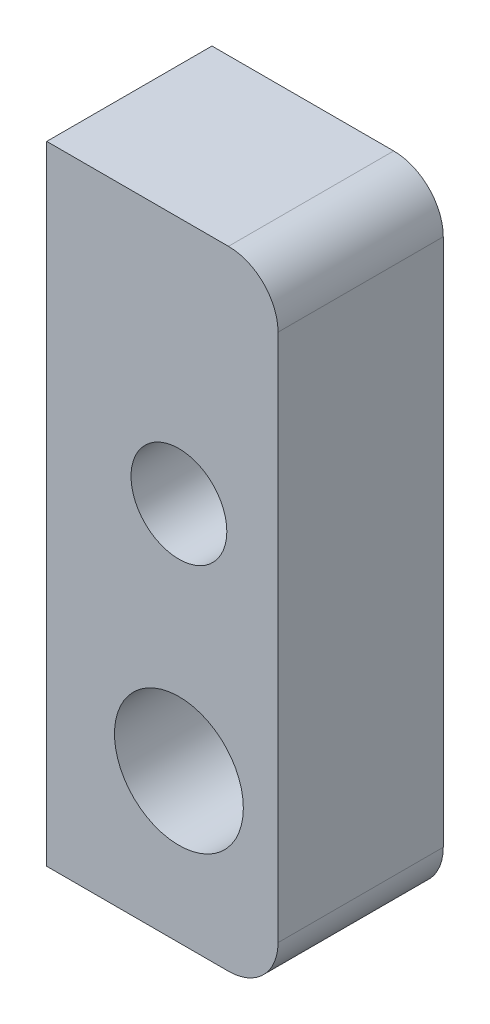
ISO-10303-21;
HEADER;
FILE_DESCRIPTION(('STEP AP214'),'2;1');
FILE_NAME('part.step','',(''),(''),'','','');
FILE_SCHEMA(('AUTOMOTIVE_DESIGN { 1 0 10303 214 1 1 1 1 }'));
ENDSEC;
DATA;
#1=APPLICATION_CONTEXT('core data for automotive mechanical design processes');
#2=APPLICATION_PROTOCOL_DEFINITION('international standard','automotive_design',2000,#1);
#3=PRODUCT_CONTEXT('',#1,'mechanical');
#4=PRODUCT('Part','Part','',(#3));
#5=PRODUCT_RELATED_PRODUCT_CATEGORY('part','',(#4));
#6=PRODUCT_DEFINITION_FORMATION('','',#4);
#7=PRODUCT_DEFINITION_CONTEXT('part definition',#1,'design');
#8=PRODUCT_DEFINITION('design','',#6,#7);
#9=PRODUCT_DEFINITION_SHAPE('','',#8);
#10=(LENGTH_UNIT() NAMED_UNIT(*) SI_UNIT(.MILLI.,.METRE.));
#11=(NAMED_UNIT(*) PLANE_ANGLE_UNIT() SI_UNIT($,.RADIAN.));
#12=(NAMED_UNIT(*) SI_UNIT($,.STERADIAN.) SOLID_ANGLE_UNIT());
#13=UNCERTAINTY_MEASURE_WITH_UNIT(LENGTH_MEASURE(1.E-05),#10,'distance_accuracy_value','');
#14=(GEOMETRIC_REPRESENTATION_CONTEXT(3) GLOBAL_UNCERTAINTY_ASSIGNED_CONTEXT((#13)) GLOBAL_UNIT_ASSIGNED_CONTEXT((#10,
#11,#12)) REPRESENTATION_CONTEXT('',''));
#15=CARTESIAN_POINT('',(0.,0.,0.));
#16=DIRECTION('',(0.,0.,1.));
#17=DIRECTION('',(1.,0.,0.));
#18=AXIS2_PLACEMENT_3D('',#15,#16,#17);
#19=CARTESIAN_POINT('',(20.,-9.49999999999999,-5.));
#20=DIRECTION('',(0.,-1.,0.));
#21=DIRECTION('',(0.,0.,-1.));
#22=AXIS2_PLACEMENT_3D('',#19,#20,#21);
#23=PLANE('',#22);
#24=DIRECTION('',(1.,0.,0.));
#25=VECTOR('',#24,1.);
#26=CARTESIAN_POINT('',(20.,-9.49999999999999,0.));
#27=LINE('',#26,#25);
#28=CARTESIAN_POINT('',(20.,-9.49999999999999,0.));
#29=VERTEX_POINT('',#28);
#30=CARTESIAN_POINT('',(25.5,-9.49999999999999,0.));
#31=VERTEX_POINT('',#30);
#32=EDGE_CURVE('E118',#29,#31,#27,.T.);
#33=ORIENTED_EDGE('',*,*,#32,.F.);
#34=DIRECTION('',(0.,0.,1.));
#35=VECTOR('',#34,1.);
#36=CARTESIAN_POINT('',(20.,-9.49999999999999,-5.));
#37=LINE('',#36,#35);
#38=CARTESIAN_POINT('',(20.,-9.49999999999999,-5.));
#39=VERTEX_POINT('',#38);
#40=EDGE_CURVE('E11',#39,#29,#37,.T.);
#41=ORIENTED_EDGE('',*,*,#40,.F.);
#42=DIRECTION('',(1.,0.,0.));
#43=VECTOR('',#42,1.);
#44=CARTESIAN_POINT('',(20.,-9.49999999999999,-5.));
#45=LINE('',#44,#43);
#46=CARTESIAN_POINT('',(25.5,-9.49999999999999,-5.));
#47=VERTEX_POINT('',#46);
#48=EDGE_CURVE('E133',#39,#47,#45,.T.);
#49=ORIENTED_EDGE('',*,*,#48,.T.);
#50=DIRECTION('',(0.,0.,1.));
#51=VECTOR('',#50,1.);
#52=CARTESIAN_POINT('',(25.5,-9.49999999999999,-5.));
#53=LINE('',#52,#51);
#54=EDGE_CURVE('E36',#47,#31,#53,.T.);
#55=ORIENTED_EDGE('',*,*,#54,.T.);
#56=EDGE_LOOP('',(#33,#41,#49,#55));
#57=FACE_BOUND('',#56,.T.);
#58=ADVANCED_FACE('F33',(#57),#23,.T.);
#59=CARTESIAN_POINT('',(20.,-9.49999999999999,-5.));
#60=DIRECTION('',(-1.,0.,0.));
#61=DIRECTION('',(0.,0.,1.));
#62=AXIS2_PLACEMENT_3D('',#59,#60,#61);
#63=PLANE('',#62);
#64=DIRECTION('',(0.,-1.,0.));
#65=VECTOR('',#64,1.);
#66=CARTESIAN_POINT('',(20.,-9.49999999999999,0.));
#67=LINE('',#66,#65);
#68=CARTESIAN_POINT('',(20.,9.5,0.));
#69=VERTEX_POINT('',#68);
#70=EDGE_CURVE('E131',#69,#29,#67,.T.);
#71=ORIENTED_EDGE('',*,*,#70,.F.);
#72=DIRECTION('',(0.,0.,1.));
#73=VECTOR('',#72,1.);
#74=CARTESIAN_POINT('',(20.,9.5,-5.));
#75=LINE('',#74,#73);
#76=CARTESIAN_POINT('',(20.,9.5,-5.));
#77=VERTEX_POINT('',#76);
#78=EDGE_CURVE('E42',#77,#69,#75,.T.);
#79=ORIENTED_EDGE('',*,*,#78,.F.);
#80=DIRECTION('',(0.,-1.,0.));
#81=VECTOR('',#80,1.);
#82=CARTESIAN_POINT('',(20.,-9.49999999999999,-5.));
#83=LINE('',#82,#81);
#84=EDGE_CURVE('E108',#77,#39,#83,.T.);
#85=ORIENTED_EDGE('',*,*,#84,.T.);
#86=ORIENTED_EDGE('',*,*,#40,.T.);
#87=EDGE_LOOP('',(#71,#79,#85,#86));
#88=FACE_BOUND('',#87,.T.);
#89=ADVANCED_FACE('F141',(#88),#63,.T.);
#90=CARTESIAN_POINT('',(20.,9.5,-5.));
#91=DIRECTION('',(0.,1.,0.));
#92=DIRECTION('',(0.,0.,1.));
#93=AXIS2_PLACEMENT_3D('',#90,#91,#92);
#94=PLANE('',#93);
#95=DIRECTION('',(-1.,0.,0.));
#96=VECTOR('',#95,1.);
#97=CARTESIAN_POINT('',(20.,9.5,0.));
#98=LINE('',#97,#96);
#99=CARTESIAN_POINT('',(25.5,9.5,0.));
#100=VERTEX_POINT('',#99);
#101=EDGE_CURVE('E95',#100,#69,#98,.T.);
#102=ORIENTED_EDGE('',*,*,#101,.F.);
#103=DIRECTION('',(0.,0.,1.));
#104=VECTOR('',#103,1.);
#105=CARTESIAN_POINT('',(25.5,9.5,-5.));
#106=LINE('',#105,#104);
#107=CARTESIAN_POINT('',(25.5,9.5,-5.));
#108=VERTEX_POINT('',#107);
#109=EDGE_CURVE('E90',#108,#100,#106,.T.);
#110=ORIENTED_EDGE('',*,*,#109,.F.);
#111=DIRECTION('',(-1.,0.,0.));
#112=VECTOR('',#111,1.);
#113=CARTESIAN_POINT('',(20.,9.5,-5.));
#114=LINE('',#113,#112);
#115=EDGE_CURVE('E93',#108,#77,#114,.T.);
#116=ORIENTED_EDGE('',*,*,#115,.T.);
#117=ORIENTED_EDGE('',*,*,#78,.T.);
#118=EDGE_LOOP('',(#102,#110,#116,#117));
#119=FACE_BOUND('',#118,.T.);
#120=ADVANCED_FACE('F92',(#119),#94,.T.);
#121=CARTESIAN_POINT('',(25.5,8.,-5.));
#122=DIRECTION('',(0.,0.,1.));
#123=DIRECTION('',(1.,0.,0.));
#124=AXIS2_PLACEMENT_3D('',#121,#122,#123);
#125=CYLINDRICAL_SURFACE('',#124,1.5);
#126=CARTESIAN_POINT('',(25.5,8.,0.));
#127=DIRECTION('',(0.,0.,1.));
#128=DIRECTION('',(-1.,0.,0.));
#129=AXIS2_PLACEMENT_3D('',#126,#127,#128);
#130=CIRCLE('',#129,1.5);
#131=CARTESIAN_POINT('',(27.,7.99999999999999,0.));
#132=VERTEX_POINT('',#131);
#133=EDGE_CURVE('E128',#132,#100,#130,.T.);
#134=ORIENTED_EDGE('',*,*,#133,.F.);
#135=DIRECTION('',(0.,0.,1.));
#136=VECTOR('',#135,1.);
#137=CARTESIAN_POINT('',(27.,7.99999999999999,-5.));
#138=LINE('',#137,#136);
#139=CARTESIAN_POINT('',(27.,7.99999999999999,-5.));
#140=VERTEX_POINT('',#139);
#141=EDGE_CURVE('E100',#140,#132,#138,.T.);
#142=ORIENTED_EDGE('',*,*,#141,.F.);
#143=CARTESIAN_POINT('',(25.5,8.,-5.));
#144=DIRECTION('',(0.,0.,1.));
#145=DIRECTION('',(-1.,0.,0.));
#146=AXIS2_PLACEMENT_3D('',#143,#144,#145);
#147=CIRCLE('',#146,1.5);
#148=EDGE_CURVE('E106',#140,#108,#147,.T.);
#149=ORIENTED_EDGE('',*,*,#148,.T.);
#150=ORIENTED_EDGE('',*,*,#109,.T.);
#151=EDGE_LOOP('',(#134,#142,#149,#150));
#152=FACE_BOUND('',#151,.T.);
#153=ADVANCED_FACE('F110',(#152),#125,.T.);
#154=CARTESIAN_POINT('',(27.,-7.99999999999998,-5.));
#155=DIRECTION('',(1.,0.,0.));
#156=DIRECTION('',(0.,0.,-1.));
#157=AXIS2_PLACEMENT_3D('',#154,#155,#156);
#158=PLANE('',#157);
#159=DIRECTION('',(0.,1.,0.));
#160=VECTOR('',#159,1.);
#161=CARTESIAN_POINT('',(27.,-7.99999999999998,0.));
#162=LINE('',#161,#160);
#163=CARTESIAN_POINT('',(27.,-7.99999999999998,0.));
#164=VERTEX_POINT('',#163);
#165=EDGE_CURVE('E125',#164,#132,#162,.T.);
#166=ORIENTED_EDGE('',*,*,#165,.F.);
#167=DIRECTION('',(0.,0.,1.));
#168=VECTOR('',#167,1.);
#169=CARTESIAN_POINT('',(27.,-7.99999999999998,-5.));
#170=LINE('',#169,#168);
#171=CARTESIAN_POINT('',(27.,-7.99999999999998,-5.));
#172=VERTEX_POINT('',#171);
#173=EDGE_CURVE('E136',#172,#164,#170,.T.);
#174=ORIENTED_EDGE('',*,*,#173,.F.);
#175=DIRECTION('',(0.,1.,0.));
#176=VECTOR('',#175,1.);
#177=CARTESIAN_POINT('',(27.,-7.99999999999998,-5.));
#178=LINE('',#177,#176);
#179=EDGE_CURVE('E111',#172,#140,#178,.T.);
#180=ORIENTED_EDGE('',*,*,#179,.T.);
#181=ORIENTED_EDGE('',*,*,#141,.T.);
#182=EDGE_LOOP('',(#166,#174,#180,#181));
#183=FACE_BOUND('',#182,.T.);
#184=ADVANCED_FACE('F154',(#183),#158,.T.);
#185=CARTESIAN_POINT('',(25.5,-7.99999999999999,-5.));
#186=DIRECTION('',(0.,0.,1.));
#187=DIRECTION('',(1.,0.,0.));
#188=AXIS2_PLACEMENT_3D('',#185,#186,#187);
#189=CYLINDRICAL_SURFACE('',#188,1.5);
#190=CARTESIAN_POINT('',(25.5,-7.99999999999999,0.));
#191=DIRECTION('',(0.,0.,1.));
#192=DIRECTION('',(1.,0.,0.));
#193=AXIS2_PLACEMENT_3D('',#190,#191,#192);
#194=CIRCLE('',#193,1.5);
#195=EDGE_CURVE('E121',#31,#164,#194,.T.);
#196=ORIENTED_EDGE('',*,*,#195,.F.);
#197=ORIENTED_EDGE('',*,*,#54,.F.);
#198=CARTESIAN_POINT('',(25.5,-7.99999999999999,-5.));
#199=DIRECTION('',(0.,0.,1.));
#200=DIRECTION('',(1.,0.,0.));
#201=AXIS2_PLACEMENT_3D('',#198,#199,#200);
#202=CIRCLE('',#201,1.5);
#203=EDGE_CURVE('E113',#47,#172,#202,.T.);
#204=ORIENTED_EDGE('',*,*,#203,.T.);
#205=ORIENTED_EDGE('',*,*,#173,.T.);
#206=EDGE_LOOP('',(#196,#197,#204,#205));
#207=FACE_BOUND('',#206,.T.);
#208=ADVANCED_FACE('F138',(#207),#189,.T.);
#209=CARTESIAN_POINT('',(25.5,-7.99999999999999,-5.));
#210=DIRECTION('',(0.,0.,1.));
#211=DIRECTION('',(1.,0.,0.));
#212=AXIS2_PLACEMENT_3D('',#209,#210,#211);
#213=PLANE('',#212);
#214=CARTESIAN_POINT('',(24.,2.,-5.));
#215=DIRECTION('',(0.,0.,1.));
#216=DIRECTION('',(1.,0.,0.));
#217=AXIS2_PLACEMENT_3D('',#214,#215,#216);
#218=CIRCLE('',#217,1.45);
#219=CARTESIAN_POINT('',(25.45,2.,-5.));
#220=VERTEX_POINT('',#219);
#221=EDGE_CURVE('E180',#220,#220,#218,.T.);
#222=ORIENTED_EDGE('',*,*,#221,.T.);
#223=EDGE_LOOP('',(#222));
#224=FACE_BOUND('',#223,.T.);
#225=CARTESIAN_POINT('',(24.,-5.,-5.));
#226=DIRECTION('',(0.,0.,1.));
#227=DIRECTION('',(1.,0.,0.));
#228=AXIS2_PLACEMENT_3D('',#225,#226,#227);
#229=CIRCLE('',#228,1.95);
#230=CARTESIAN_POINT('',(25.95,-5.,-5.));
#231=VERTEX_POINT('',#230);
#232=EDGE_CURVE('E122',#231,#231,#229,.T.);
#233=ORIENTED_EDGE('',*,*,#232,.T.);
#234=EDGE_LOOP('',(#233));
#235=FACE_BOUND('',#234,.T.);
#236=ORIENTED_EDGE('',*,*,#48,.F.);
#237=ORIENTED_EDGE('',*,*,#84,.F.);
#238=ORIENTED_EDGE('',*,*,#115,.F.);
#239=ORIENTED_EDGE('',*,*,#148,.F.);
#240=ORIENTED_EDGE('',*,*,#179,.F.);
#241=ORIENTED_EDGE('',*,*,#203,.F.);
#242=EDGE_LOOP('',(#236,#237,#238,#239,#240,#241));
#243=FACE_BOUND('',#242,.T.);
#244=ADVANCED_FACE('F104',(#224,#235,#243),#213,.F.);
#245=CARTESIAN_POINT('',(25.5,-7.99999999999999,0.));
#246=DIRECTION('',(0.,0.,1.));
#247=DIRECTION('',(1.,0.,0.));
#248=AXIS2_PLACEMENT_3D('',#245,#246,#247);
#249=PLANE('',#248);
#250=CARTESIAN_POINT('',(24.,2.,0.));
#251=DIRECTION('',(0.,0.,1.));
#252=DIRECTION('',(1.,0.,0.));
#253=AXIS2_PLACEMENT_3D('',#250,#251,#252);
#254=CIRCLE('',#253,1.45);
#255=CARTESIAN_POINT('',(25.45,2.,0.));
#256=VERTEX_POINT('',#255);
#257=EDGE_CURVE('E183',#256,#256,#254,.T.);
#258=ORIENTED_EDGE('',*,*,#257,.F.);
#259=EDGE_LOOP('',(#258));
#260=FACE_BOUND('',#259,.T.);
#261=CARTESIAN_POINT('',(24.,-5.,0.));
#262=DIRECTION('',(0.,0.,1.));
#263=DIRECTION('',(1.,0.,0.));
#264=AXIS2_PLACEMENT_3D('',#261,#262,#263);
#265=CIRCLE('',#264,1.95);
#266=CARTESIAN_POINT('',(25.95,-5.,0.));
#267=VERTEX_POINT('',#266);
#268=EDGE_CURVE('E185',#267,#267,#265,.T.);
#269=ORIENTED_EDGE('',*,*,#268,.F.);
#270=EDGE_LOOP('',(#269));
#271=FACE_BOUND('',#270,.T.);
#272=ORIENTED_EDGE('',*,*,#32,.T.);
#273=ORIENTED_EDGE('',*,*,#195,.T.);
#274=ORIENTED_EDGE('',*,*,#165,.T.);
#275=ORIENTED_EDGE('',*,*,#133,.T.);
#276=ORIENTED_EDGE('',*,*,#101,.T.);
#277=ORIENTED_EDGE('',*,*,#70,.T.);
#278=EDGE_LOOP('',(#272,#273,#274,#275,#276,#277));
#279=FACE_BOUND('',#278,.T.);
#280=ADVANCED_FACE('F140',(#260,#271,#279),#249,.T.);
#281=CARTESIAN_POINT('',(24.,-5.,-5.));
#282=DIRECTION('',(0.,0.,1.));
#283=DIRECTION('',(1.,0.,0.));
#284=AXIS2_PLACEMENT_3D('',#281,#282,#283);
#285=CYLINDRICAL_SURFACE('',#284,1.95);
#286=ORIENTED_EDGE('',*,*,#232,.F.);
#287=EDGE_LOOP('',(#286));
#288=FACE_BOUND('',#287,.T.);
#289=ORIENTED_EDGE('',*,*,#268,.T.);
#290=EDGE_LOOP('',(#289));
#291=FACE_BOUND('',#290,.T.);
#292=ADVANCED_FACE('F165',(#288,#291),#285,.F.);
#293=CARTESIAN_POINT('',(24.,2.,-5.));
#294=DIRECTION('',(0.,0.,1.));
#295=DIRECTION('',(1.,0.,0.));
#296=AXIS2_PLACEMENT_3D('',#293,#294,#295);
#297=CYLINDRICAL_SURFACE('',#296,1.45);
#298=ORIENTED_EDGE('',*,*,#221,.F.);
#299=EDGE_LOOP('',(#298));
#300=FACE_BOUND('',#299,.T.);
#301=ORIENTED_EDGE('',*,*,#257,.T.);
#302=EDGE_LOOP('',(#301));
#303=FACE_BOUND('',#302,.T.);
#304=ADVANCED_FACE('F172',(#300,#303),#297,.F.);
#305=CLOSED_SHELL('',(#58,#89,#120,#153,#184,#208,#244,#280,#292,#304));
#306=MANIFOLD_SOLID_BREP('B2',#305);
#307=ADVANCED_BREP_SHAPE_REPRESENTATION('',(#18,#306),#14);
#308=SHAPE_DEFINITION_REPRESENTATION(#9,#307);
ENDSEC;
END-ISO-10303-21;
